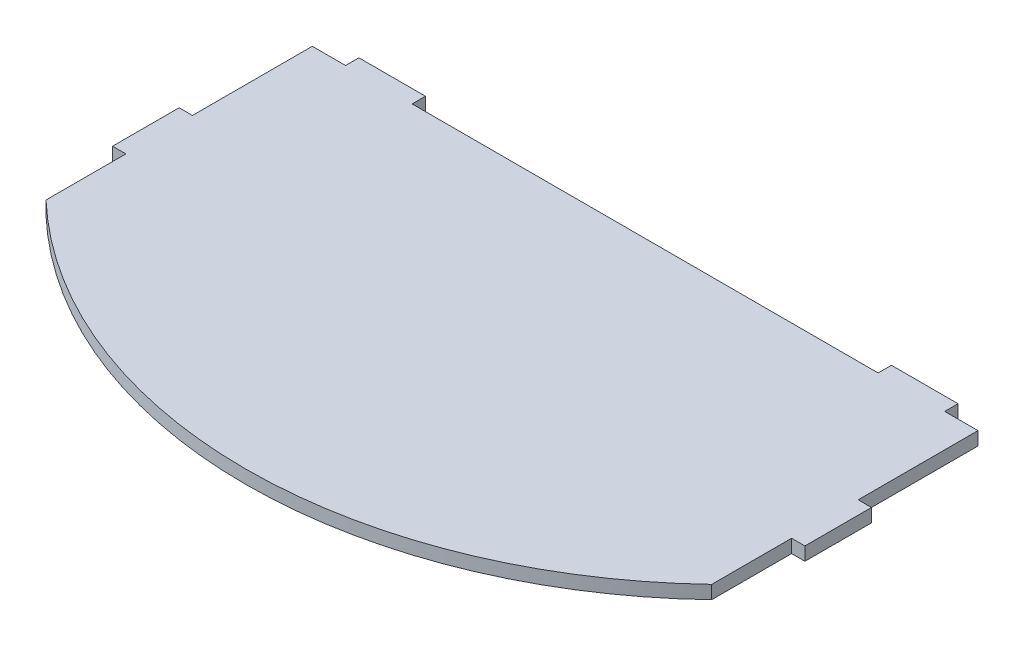
ISO-10303-21;
HEADER;
FILE_DESCRIPTION(('STEP AP214'),'2;1');
FILE_NAME('part.step','',(''),(''),'','','');
FILE_SCHEMA(('AUTOMOTIVE_DESIGN { 1 0 10303 214 1 1 1 1 }'));
ENDSEC;
DATA;
#1=APPLICATION_CONTEXT('core data for automotive mechanical design processes');
#2=APPLICATION_PROTOCOL_DEFINITION('international standard','automotive_design',2000,#1);
#3=PRODUCT_CONTEXT('',#1,'mechanical');
#4=PRODUCT('Part','Part','',(#3));
#5=PRODUCT_RELATED_PRODUCT_CATEGORY('part','',(#4));
#6=PRODUCT_DEFINITION_FORMATION('','',#4);
#7=PRODUCT_DEFINITION_CONTEXT('part definition',#1,'design');
#8=PRODUCT_DEFINITION('design','',#6,#7);
#9=PRODUCT_DEFINITION_SHAPE('','',#8);
#10=(LENGTH_UNIT() NAMED_UNIT(*) SI_UNIT(.MILLI.,.METRE.));
#11=(NAMED_UNIT(*) PLANE_ANGLE_UNIT() SI_UNIT($,.RADIAN.));
#12=(NAMED_UNIT(*) SI_UNIT($,.STERADIAN.) SOLID_ANGLE_UNIT());
#13=UNCERTAINTY_MEASURE_WITH_UNIT(LENGTH_MEASURE(1.E-05),#10,'distance_accuracy_value','');
#14=(GEOMETRIC_REPRESENTATION_CONTEXT(3) GLOBAL_UNCERTAINTY_ASSIGNED_CONTEXT((#13)) GLOBAL_UNIT_ASSIGNED_CONTEXT((#10,
#11,#12)) REPRESENTATION_CONTEXT('',''));
#15=CARTESIAN_POINT('',(0.,0.,0.));
#16=DIRECTION('',(0.,0.,1.));
#17=DIRECTION('',(1.,0.,0.));
#18=AXIS2_PLACEMENT_3D('',#15,#16,#17);
#19=CARTESIAN_POINT('',(70.,4.,0.));
#20=DIRECTION('',(-1.,0.,0.));
#21=DIRECTION('',(0.,0.,1.));
#22=AXIS2_PLACEMENT_3D('',#19,#20,#21);
#23=PLANE('',#22);
#24=DIRECTION('',(0.,0.,-1.));
#25=VECTOR('',#24,1.);
#26=CARTESIAN_POINT('',(70.,0.,0.));
#27=LINE('',#26,#25);
#28=CARTESIAN_POINT('',(70.,0.,-60.));
#29=VERTEX_POINT('',#28);
#30=CARTESIAN_POINT('',(70.,0.,-64.));
#31=VERTEX_POINT('',#30);
#32=EDGE_CURVE('E343',#29,#31,#27,.T.);
#33=ORIENTED_EDGE('',*,*,#32,.F.);
#34=DIRECTION('',(0.,-1.,0.));
#35=VECTOR('',#34,1.);
#36=CARTESIAN_POINT('',(70.,4.,-60.));
#37=LINE('',#36,#35);
#38=CARTESIAN_POINT('',(70.,4.,-60.));
#39=VERTEX_POINT('',#38);
#40=EDGE_CURVE('E377',#39,#29,#37,.T.);
#41=ORIENTED_EDGE('',*,*,#40,.F.);
#42=DIRECTION('',(0.,0.,-1.));
#43=VECTOR('',#42,1.);
#44=CARTESIAN_POINT('',(70.,4.,0.));
#45=LINE('',#44,#43);
#46=CARTESIAN_POINT('',(70.,4.,-64.));
#47=VERTEX_POINT('',#46);
#48=EDGE_CURVE('E342',#39,#47,#45,.T.);
#49=ORIENTED_EDGE('',*,*,#48,.T.);
#50=DIRECTION('',(0.,-1.,0.));
#51=VECTOR('',#50,1.);
#52=CARTESIAN_POINT('',(70.,4.,-64.));
#53=LINE('',#52,#51);
#54=EDGE_CURVE('E405',#47,#31,#53,.T.);
#55=ORIENTED_EDGE('',*,*,#54,.T.);
#56=EDGE_LOOP('',(#33,#41,#49,#55));
#57=FACE_BOUND('',#56,.T.);
#58=ADVANCED_FACE('F131',(#57),#23,.T.);
#59=CARTESIAN_POINT('',(0.,4.,-64.));
#60=DIRECTION('',(0.,0.,-1.));
#61=DIRECTION('',(-1.,0.,0.));
#62=AXIS2_PLACEMENT_3D('',#59,#60,#61);
#63=PLANE('',#62);
#64=DIRECTION('',(1.,0.,0.));
#65=VECTOR('',#64,1.);
#66=CARTESIAN_POINT('',(0.,0.,-64.));
#67=LINE('',#66,#65);
#68=CARTESIAN_POINT('',(90.,0.,-64.));
#69=VERTEX_POINT('',#68);
#70=EDGE_CURVE('E348',#31,#69,#67,.T.);
#71=ORIENTED_EDGE('',*,*,#70,.F.);
#72=ORIENTED_EDGE('',*,*,#54,.F.);
#73=DIRECTION('',(1.,0.,0.));
#74=VECTOR('',#73,1.);
#75=CARTESIAN_POINT('',(0.,4.,-64.));
#76=LINE('',#75,#74);
#77=CARTESIAN_POINT('',(90.,4.,-64.));
#78=VERTEX_POINT('',#77);
#79=EDGE_CURVE('E373',#47,#78,#76,.T.);
#80=ORIENTED_EDGE('',*,*,#79,.T.);
#81=DIRECTION('',(0.,-1.,0.));
#82=VECTOR('',#81,1.);
#83=CARTESIAN_POINT('',(90.,4.,-64.));
#84=LINE('',#83,#82);
#85=EDGE_CURVE('E407',#78,#69,#84,.T.);
#86=ORIENTED_EDGE('',*,*,#85,.T.);
#87=EDGE_LOOP('',(#71,#72,#80,#86));
#88=FACE_BOUND('',#87,.T.);
#89=ADVANCED_FACE('F477',(#88),#63,.T.);
#90=CARTESIAN_POINT('',(90.,4.,0.));
#91=DIRECTION('',(-1.,0.,0.));
#92=DIRECTION('',(0.,0.,1.));
#93=AXIS2_PLACEMENT_3D('',#90,#91,#92);
#94=PLANE('',#93);
#95=DIRECTION('',(0.,0.,-1.));
#96=VECTOR('',#95,1.);
#97=CARTESIAN_POINT('',(90.,0.,0.));
#98=LINE('',#97,#96);
#99=CARTESIAN_POINT('',(90.,0.,-60.));
#100=VERTEX_POINT('',#99);
#101=EDGE_CURVE('E399',#100,#69,#98,.T.);
#102=ORIENTED_EDGE('',*,*,#101,.T.);
#103=ORIENTED_EDGE('',*,*,#85,.F.);
#104=DIRECTION('',(0.,0.,-1.));
#105=VECTOR('',#104,1.);
#106=CARTESIAN_POINT('',(90.,4.,0.));
#107=LINE('',#106,#105);
#108=CARTESIAN_POINT('',(90.,4.,-60.));
#109=VERTEX_POINT('',#108);
#110=EDGE_CURVE('E351',#109,#78,#107,.T.);
#111=ORIENTED_EDGE('',*,*,#110,.F.);
#112=DIRECTION('',(0.,-1.,0.));
#113=VECTOR('',#112,1.);
#114=CARTESIAN_POINT('',(90.,4.,-60.));
#115=LINE('',#114,#113);
#116=EDGE_CURVE('E409',#109,#100,#115,.T.);
#117=ORIENTED_EDGE('',*,*,#116,.T.);
#118=EDGE_LOOP('',(#102,#103,#111,#117));
#119=FACE_BOUND('',#118,.T.);
#120=ADVANCED_FACE('F483',(#119),#94,.F.);
#121=CARTESIAN_POINT('',(-90.,4.,0.));
#122=DIRECTION('',(-1.,0.,0.));
#123=DIRECTION('',(0.,0.,1.));
#124=AXIS2_PLACEMENT_3D('',#121,#122,#123);
#125=PLANE('',#124);
#126=DIRECTION('',(0.,0.,-1.));
#127=VECTOR('',#126,1.);
#128=CARTESIAN_POINT('',(-90.,0.,0.));
#129=LINE('',#128,#127);
#130=CARTESIAN_POINT('',(-90.,0.,-60.));
#131=VERTEX_POINT('',#130);
#132=CARTESIAN_POINT('',(-90.,0.,-64.));
#133=VERTEX_POINT('',#132);
#134=EDGE_CURVE('E386',#131,#133,#129,.T.);
#135=ORIENTED_EDGE('',*,*,#134,.F.);
#136=DIRECTION('',(0.,-1.,0.));
#137=VECTOR('',#136,1.);
#138=CARTESIAN_POINT('',(-90.,4.,-60.));
#139=LINE('',#138,#137);
#140=CARTESIAN_POINT('',(-90.,4.,-60.));
#141=VERTEX_POINT('',#140);
#142=EDGE_CURVE('E421',#141,#131,#139,.T.);
#143=ORIENTED_EDGE('',*,*,#142,.F.);
#144=DIRECTION('',(0.,0.,-1.));
#145=VECTOR('',#144,1.);
#146=CARTESIAN_POINT('',(-90.,4.,0.));
#147=LINE('',#146,#145);
#148=CARTESIAN_POINT('',(-90.,4.,-64.));
#149=VERTEX_POINT('',#148);
#150=EDGE_CURVE('E355',#141,#149,#147,.T.);
#151=ORIENTED_EDGE('',*,*,#150,.T.);
#152=DIRECTION('',(0.,-1.,0.));
#153=VECTOR('',#152,1.);
#154=CARTESIAN_POINT('',(-90.,4.,-64.));
#155=LINE('',#154,#153);
#156=EDGE_CURVE('E423',#149,#133,#155,.T.);
#157=ORIENTED_EDGE('',*,*,#156,.T.);
#158=EDGE_LOOP('',(#135,#143,#151,#157));
#159=FACE_BOUND('',#158,.T.);
#160=ADVANCED_FACE('F492',(#159),#125,.T.);
#161=CARTESIAN_POINT('',(0.,4.,-64.));
#162=DIRECTION('',(0.,0.,-1.));
#163=DIRECTION('',(-1.,0.,0.));
#164=AXIS2_PLACEMENT_3D('',#161,#162,#163);
#165=PLANE('',#164);
#166=DIRECTION('',(1.,0.,0.));
#167=VECTOR('',#166,1.);
#168=CARTESIAN_POINT('',(0.,0.,-64.));
#169=LINE('',#168,#167);
#170=CARTESIAN_POINT('',(-70.,0.,-64.));
#171=VERTEX_POINT('',#170);
#172=EDGE_CURVE('E383',#133,#171,#169,.T.);
#173=ORIENTED_EDGE('',*,*,#172,.F.);
#174=ORIENTED_EDGE('',*,*,#156,.F.);
#175=DIRECTION('',(1.,0.,0.));
#176=VECTOR('',#175,1.);
#177=CARTESIAN_POINT('',(0.,4.,-64.));
#178=LINE('',#177,#176);
#179=CARTESIAN_POINT('',(-70.,4.,-64.));
#180=VERTEX_POINT('',#179);
#181=EDGE_CURVE('E338',#149,#180,#178,.T.);
#182=ORIENTED_EDGE('',*,*,#181,.T.);
#183=DIRECTION('',(0.,-1.,0.));
#184=VECTOR('',#183,1.);
#185=CARTESIAN_POINT('',(-70.,4.,-64.));
#186=LINE('',#185,#184);
#187=EDGE_CURVE('E331',#180,#171,#186,.T.);
#188=ORIENTED_EDGE('',*,*,#187,.T.);
#189=EDGE_LOOP('',(#173,#174,#182,#188));
#190=FACE_BOUND('',#189,.T.);
#191=ADVANCED_FACE('F506',(#190),#165,.T.);
#192=CARTESIAN_POINT('',(-70.,4.,0.));
#193=DIRECTION('',(-1.,0.,0.));
#194=DIRECTION('',(0.,0.,1.));
#195=AXIS2_PLACEMENT_3D('',#192,#193,#194);
#196=PLANE('',#195);
#197=DIRECTION('',(0.,0.,-1.));
#198=VECTOR('',#197,1.);
#199=CARTESIAN_POINT('',(-70.,0.,0.));
#200=LINE('',#199,#198);
#201=CARTESIAN_POINT('',(-70.,0.,-60.));
#202=VERTEX_POINT('',#201);
#203=EDGE_CURVE('E379',#202,#171,#200,.T.);
#204=ORIENTED_EDGE('',*,*,#203,.T.);
#205=ORIENTED_EDGE('',*,*,#187,.F.);
#206=DIRECTION('',(0.,0.,-1.));
#207=VECTOR('',#206,1.);
#208=CARTESIAN_POINT('',(-70.,4.,0.));
#209=LINE('',#208,#207);
#210=CARTESIAN_POINT('',(-70.,4.,-60.));
#211=VERTEX_POINT('',#210);
#212=EDGE_CURVE('E334',#211,#180,#209,.T.);
#213=ORIENTED_EDGE('',*,*,#212,.F.);
#214=DIRECTION('',(0.,-1.,0.));
#215=VECTOR('',#214,1.);
#216=CARTESIAN_POINT('',(-70.,4.,-60.));
#217=LINE('',#216,#215);
#218=EDGE_CURVE('E218',#211,#202,#217,.T.);
#219=ORIENTED_EDGE('',*,*,#218,.T.);
#220=EDGE_LOOP('',(#204,#205,#213,#219));
#221=FACE_BOUND('',#220,.T.);
#222=ADVANCED_FACE('F335',(#221),#196,.F.);
#223=CARTESIAN_POINT('',(0.,4.,-60.));
#224=DIRECTION('',(0.,0.,-1.));
#225=DIRECTION('',(-1.,0.,0.));
#226=AXIS2_PLACEMENT_3D('',#223,#224,#225);
#227=PLANE('',#226);
#228=DIRECTION('',(1.,0.,0.));
#229=VECTOR('',#228,1.);
#230=CARTESIAN_POINT('',(0.,0.,-60.));
#231=LINE('',#230,#229);
#232=EDGE_CURVE('E231',#202,#29,#231,.T.);
#233=ORIENTED_EDGE('',*,*,#232,.F.);
#234=ORIENTED_EDGE('',*,*,#218,.F.);
#235=DIRECTION('',(1.,0.,0.));
#236=VECTOR('',#235,1.);
#237=CARTESIAN_POINT('',(0.,4.,-60.));
#238=LINE('',#237,#236);
#239=EDGE_CURVE('E326',#211,#39,#238,.T.);
#240=ORIENTED_EDGE('',*,*,#239,.T.);
#241=ORIENTED_EDGE('',*,*,#40,.T.);
#242=EDGE_LOOP('',(#233,#234,#240,#241));
#243=FACE_BOUND('',#242,.T.);
#244=ADVANCED_FACE('F325',(#243),#227,.T.);
#245=CARTESIAN_POINT('',(-99.9999999999999,0.,-60.));
#246=VERTEX_POINT('',#245);
#247=EDGE_CURVE('E381',#246,#131,#231,.T.);
#248=ORIENTED_EDGE('',*,*,#247,.F.);
#249=DIRECTION('',(0.,-1.,0.));
#250=VECTOR('',#249,1.);
#251=CARTESIAN_POINT('',(-99.9999999999999,4.,-60.));
#252=LINE('',#251,#250);
#253=CARTESIAN_POINT('',(-99.9999999999999,4.,-60.));
#254=VERTEX_POINT('',#253);
#255=EDGE_CURVE('E419',#254,#246,#252,.T.);
#256=ORIENTED_EDGE('',*,*,#255,.F.);
#257=EDGE_CURVE('E346',#254,#141,#238,.T.);
#258=ORIENTED_EDGE('',*,*,#257,.T.);
#259=ORIENTED_EDGE('',*,*,#142,.T.);
#260=EDGE_LOOP('',(#248,#256,#258,#259));
#261=FACE_BOUND('',#260,.T.);
#262=ADVANCED_FACE('F454',(#261),#227,.T.);
#263=CARTESIAN_POINT('',(0.,4.,-85.));
#264=DIRECTION('',(0.,-1.,0.));
#265=DIRECTION('',(0.,0.,-1.));
#266=AXIS2_PLACEMENT_3D('',#263,#264,#265);
#267=CYLINDRICAL_SURFACE('',#266,145.);
#268=CARTESIAN_POINT('',(0.,0.,-85.));
#269=DIRECTION('',(0.,1.,0.));
#270=DIRECTION('',(0.,0.,1.));
#271=AXIS2_PLACEMENT_3D('',#268,#269,#270);
#272=CIRCLE('',#271,145.);
#273=CARTESIAN_POINT('',(100.,0.,20.));
#274=VERTEX_POINT('',#273);
#275=CARTESIAN_POINT('',(-99.9999999999999,0.,20.));
#276=VERTEX_POINT('',#275);
#277=EDGE_CURVE('E392',#274,#276,#272,.F.);
#278=ORIENTED_EDGE('',*,*,#277,.F.);
#279=DIRECTION('',(0.,-1.,0.));
#280=VECTOR('',#279,1.);
#281=CARTESIAN_POINT('',(100.,4.,20.));
#282=LINE('',#281,#280);
#283=CARTESIAN_POINT('',(100.,4.,20.));
#284=VERTEX_POINT('',#283);
#285=EDGE_CURVE('E413',#284,#274,#282,.T.);
#286=ORIENTED_EDGE('',*,*,#285,.F.);
#287=CARTESIAN_POINT('',(0.,4.,-85.));
#288=DIRECTION('',(0.,1.,0.));
#289=DIRECTION('',(0.,0.,1.));
#290=AXIS2_PLACEMENT_3D('',#287,#288,#289);
#291=CIRCLE('',#290,145.);
#292=CARTESIAN_POINT('',(-99.9999999999999,4.,20.));
#293=VERTEX_POINT('',#292);
#294=EDGE_CURVE('E367',#284,#293,#291,.F.);
#295=ORIENTED_EDGE('',*,*,#294,.T.);
#296=DIRECTION('',(0.,-1.,0.));
#297=VECTOR('',#296,1.);
#298=CARTESIAN_POINT('',(-99.9999999999999,4.,20.));
#299=LINE('',#298,#297);
#300=EDGE_CURVE('E416',#293,#276,#299,.T.);
#301=ORIENTED_EDGE('',*,*,#300,.T.);
#302=EDGE_LOOP('',(#278,#286,#295,#301));
#303=FACE_BOUND('',#302,.T.);
#304=ADVANCED_FACE('F496',(#303),#267,.T.);
#305=CARTESIAN_POINT('',(100.,0.,-60.));
#306=VERTEX_POINT('',#305);
#307=EDGE_CURVE('E380',#100,#306,#231,.T.);
#308=ORIENTED_EDGE('',*,*,#307,.F.);
#309=ORIENTED_EDGE('',*,*,#116,.F.);
#310=CARTESIAN_POINT('',(100.,4.,-60.));
#311=VERTEX_POINT('',#310);
#312=EDGE_CURVE('E345',#109,#311,#238,.T.);
#313=ORIENTED_EDGE('',*,*,#312,.T.);
#314=DIRECTION('',(0.,-1.,0.));
#315=VECTOR('',#314,1.);
#316=CARTESIAN_POINT('',(100.,4.,-60.));
#317=LINE('',#316,#315);
#318=EDGE_CURVE('E411',#311,#306,#317,.T.);
#319=ORIENTED_EDGE('',*,*,#318,.T.);
#320=EDGE_LOOP('',(#308,#309,#313,#319));
#321=FACE_BOUND('',#320,.T.);
#322=ADVANCED_FACE('F461',(#321),#227,.T.);
#323=CARTESIAN_POINT('',(0.,0.,0.));
#324=DIRECTION('',(0.,1.,0.));
#325=DIRECTION('',(0.,0.,1.));
#326=AXIS2_PLACEMENT_3D('',#323,#324,#325);
#327=PLANE('',#326);
#328=ORIENTED_EDGE('',*,*,#232,.T.);
#329=ORIENTED_EDGE('',*,*,#32,.T.);
#330=ORIENTED_EDGE('',*,*,#70,.T.);
#331=ORIENTED_EDGE('',*,*,#101,.F.);
#332=ORIENTED_EDGE('',*,*,#307,.T.);
#333=DIRECTION('',(0.,0.,1.));
#334=VECTOR('',#333,1.);
#335=CARTESIAN_POINT('',(100.,0.,0.));
#336=LINE('',#335,#334);
#337=CARTESIAN_POINT('',(100.,0.,-24.));
#338=VERTEX_POINT('',#337);
#339=EDGE_CURVE('E397',#306,#338,#336,.T.);
#340=ORIENTED_EDGE('',*,*,#339,.T.);
#341=DIRECTION('',(1.,0.,0.));
#342=VECTOR('',#341,1.);
#343=CARTESIAN_POINT('',(99.9999999999999,0.,-24.));
#344=LINE('',#343,#342);
#345=CARTESIAN_POINT('',(104.,0.,-24.));
#346=VERTEX_POINT('',#345);
#347=EDGE_CURVE('E210',#338,#346,#344,.T.);
#348=ORIENTED_EDGE('',*,*,#347,.T.);
#349=DIRECTION('',(0.,0.,1.));
#350=VECTOR('',#349,1.);
#351=CARTESIAN_POINT('',(104.,0.,-24.));
#352=LINE('',#351,#350);
#353=CARTESIAN_POINT('',(104.,0.,-3.99999999999998));
#354=VERTEX_POINT('',#353);
#355=EDGE_CURVE('E188',#346,#354,#352,.T.);
#356=ORIENTED_EDGE('',*,*,#355,.T.);
#357=DIRECTION('',(1.,0.,0.));
#358=VECTOR('',#357,1.);
#359=CARTESIAN_POINT('',(99.9999999999999,0.,-3.99999999999998));
#360=LINE('',#359,#358);
#361=CARTESIAN_POINT('',(100.,0.,-3.99999999999998));
#362=VERTEX_POINT('',#361);
#363=EDGE_CURVE('E197',#362,#354,#360,.T.);
#364=ORIENTED_EDGE('',*,*,#363,.F.);
#365=EDGE_CURVE('E396',#362,#274,#336,.T.);
#366=ORIENTED_EDGE('',*,*,#365,.T.);
#367=ORIENTED_EDGE('',*,*,#277,.T.);
#368=DIRECTION('',(0.,0.,1.));
#369=VECTOR('',#368,1.);
#370=CARTESIAN_POINT('',(-99.9999999999999,0.,0.));
#371=LINE('',#370,#369);
#372=CARTESIAN_POINT('',(-99.9999999999999,0.,-3.99999999999998));
#373=VERTEX_POINT('',#372);
#374=EDGE_CURVE('E393',#373,#276,#371,.T.);
#375=ORIENTED_EDGE('',*,*,#374,.F.);
#376=DIRECTION('',(-1.,0.,0.));
#377=VECTOR('',#376,1.);
#378=CARTESIAN_POINT('',(-99.9999999999999,0.,-3.99999999999998));
#379=LINE('',#378,#377);
#380=CARTESIAN_POINT('',(-104.,0.,-3.99999999999998));
#381=VERTEX_POINT('',#380);
#382=EDGE_CURVE('E430',#373,#381,#379,.T.);
#383=ORIENTED_EDGE('',*,*,#382,.T.);
#384=DIRECTION('',(0.,0.,1.));
#385=VECTOR('',#384,1.);
#386=CARTESIAN_POINT('',(-104.,0.,-24.));
#387=LINE('',#386,#385);
#388=CARTESIAN_POINT('',(-104.,0.,-24.));
#389=VERTEX_POINT('',#388);
#390=EDGE_CURVE('E435',#389,#381,#387,.T.);
#391=ORIENTED_EDGE('',*,*,#390,.F.);
#392=DIRECTION('',(-1.,0.,0.));
#393=VECTOR('',#392,1.);
#394=CARTESIAN_POINT('',(-99.9999999999999,0.,-24.));
#395=LINE('',#394,#393);
#396=CARTESIAN_POINT('',(-99.9999999999999,0.,-24.));
#397=VERTEX_POINT('',#396);
#398=EDGE_CURVE('E194',#397,#389,#395,.T.);
#399=ORIENTED_EDGE('',*,*,#398,.F.);
#400=EDGE_CURVE('E389',#246,#397,#371,.T.);
#401=ORIENTED_EDGE('',*,*,#400,.F.);
#402=ORIENTED_EDGE('',*,*,#247,.T.);
#403=ORIENTED_EDGE('',*,*,#134,.T.);
#404=ORIENTED_EDGE('',*,*,#172,.T.);
#405=ORIENTED_EDGE('',*,*,#203,.F.);
#406=EDGE_LOOP('',(#328,#329,#330,#331,#332,#340,#348,#356,#364,#366,#367,#375,#383,#391,#399,
#401,#402,#403,#404,#405));
#407=FACE_BOUND('',#406,.T.);
#408=ADVANCED_FACE('F208',(#407),#327,.F.);
#409=CARTESIAN_POINT('',(0.,4.,0.));
#410=DIRECTION('',(0.,1.,0.));
#411=DIRECTION('',(0.,0.,1.));
#412=AXIS2_PLACEMENT_3D('',#409,#410,#411);
#413=PLANE('',#412);
#414=ORIENTED_EDGE('',*,*,#239,.F.);
#415=ORIENTED_EDGE('',*,*,#212,.T.);
#416=ORIENTED_EDGE('',*,*,#181,.F.);
#417=ORIENTED_EDGE('',*,*,#150,.F.);
#418=ORIENTED_EDGE('',*,*,#257,.F.);
#419=DIRECTION('',(0.,0.,1.));
#420=VECTOR('',#419,1.);
#421=CARTESIAN_POINT('',(-99.9999999999999,4.,0.));
#422=LINE('',#421,#420);
#423=CARTESIAN_POINT('',(-99.9999999999999,4.,-24.));
#424=VERTEX_POINT('',#423);
#425=EDGE_CURVE('E358',#254,#424,#422,.T.);
#426=ORIENTED_EDGE('',*,*,#425,.T.);
#427=DIRECTION('',(-1.,0.,0.));
#428=VECTOR('',#427,1.);
#429=CARTESIAN_POINT('',(-99.9999999999999,4.,-24.));
#430=LINE('',#429,#428);
#431=CARTESIAN_POINT('',(-104.,4.,-24.));
#432=VERTEX_POINT('',#431);
#433=EDGE_CURVE('E426',#424,#432,#430,.T.);
#434=ORIENTED_EDGE('',*,*,#433,.T.);
#435=DIRECTION('',(0.,0.,1.));
#436=VECTOR('',#435,1.);
#437=CARTESIAN_POINT('',(-104.,4.,-24.));
#438=LINE('',#437,#436);
#439=CARTESIAN_POINT('',(-104.,4.,-3.99999999999998));
#440=VERTEX_POINT('',#439);
#441=EDGE_CURVE('E429',#432,#440,#438,.T.);
#442=ORIENTED_EDGE('',*,*,#441,.T.);
#443=DIRECTION('',(-1.,0.,0.));
#444=VECTOR('',#443,1.);
#445=CARTESIAN_POINT('',(-99.9999999999999,4.,-3.99999999999998));
#446=LINE('',#445,#444);
#447=CARTESIAN_POINT('',(-99.9999999999999,4.,-3.99999999999998));
#448=VERTEX_POINT('',#447);
#449=EDGE_CURVE('E228',#448,#440,#446,.T.);
#450=ORIENTED_EDGE('',*,*,#449,.F.);
#451=EDGE_CURVE('E354',#448,#293,#422,.T.);
#452=ORIENTED_EDGE('',*,*,#451,.T.);
#453=ORIENTED_EDGE('',*,*,#294,.F.);
#454=DIRECTION('',(0.,0.,1.));
#455=VECTOR('',#454,1.);
#456=CARTESIAN_POINT('',(100.,4.,0.));
#457=LINE('',#456,#455);
#458=CARTESIAN_POINT('',(100.,4.,-3.99999999999998));
#459=VERTEX_POINT('',#458);
#460=EDGE_CURVE('E242',#459,#284,#457,.T.);
#461=ORIENTED_EDGE('',*,*,#460,.F.);
#462=DIRECTION('',(1.,0.,0.));
#463=VECTOR('',#462,1.);
#464=CARTESIAN_POINT('',(99.9999999999999,4.,-3.99999999999998));
#465=LINE('',#464,#463);
#466=CARTESIAN_POINT('',(104.,4.,-3.99999999999998));
#467=VERTEX_POINT('',#466);
#468=EDGE_CURVE('E233',#459,#467,#465,.T.);
#469=ORIENTED_EDGE('',*,*,#468,.T.);
#470=DIRECTION('',(0.,0.,1.));
#471=VECTOR('',#470,1.);
#472=CARTESIAN_POINT('',(104.,4.,-24.));
#473=LINE('',#472,#471);
#474=CARTESIAN_POINT('',(104.,4.,-24.));
#475=VERTEX_POINT('',#474);
#476=EDGE_CURVE('E191',#475,#467,#473,.T.);
#477=ORIENTED_EDGE('',*,*,#476,.F.);
#478=DIRECTION('',(1.,0.,0.));
#479=VECTOR('',#478,1.);
#480=CARTESIAN_POINT('',(99.9999999999999,4.,-24.));
#481=LINE('',#480,#479);
#482=CARTESIAN_POINT('',(100.,4.,-24.));
#483=VERTEX_POINT('',#482);
#484=EDGE_CURVE('E205',#483,#475,#481,.T.);
#485=ORIENTED_EDGE('',*,*,#484,.F.);
#486=EDGE_CURVE('E352',#311,#483,#457,.T.);
#487=ORIENTED_EDGE('',*,*,#486,.F.);
#488=ORIENTED_EDGE('',*,*,#312,.F.);
#489=ORIENTED_EDGE('',*,*,#110,.T.);
#490=ORIENTED_EDGE('',*,*,#79,.F.);
#491=ORIENTED_EDGE('',*,*,#48,.F.);
#492=EDGE_LOOP('',(#414,#415,#416,#417,#418,#426,#434,#442,#450,#452,#453,#461,#469,#477,#485,
#487,#488,#489,#490,#491));
#493=FACE_BOUND('',#492,.T.);
#494=ADVANCED_FACE('F237',(#493),#413,.T.);
#495=CARTESIAN_POINT('',(100.,4.,0.));
#496=DIRECTION('',(1.,0.,0.));
#497=DIRECTION('',(0.,0.,-1.));
#498=AXIS2_PLACEMENT_3D('',#495,#496,#497);
#499=PLANE('',#498);
#500=ORIENTED_EDGE('',*,*,#486,.T.);
#501=DIRECTION('',(0.,-1.,0.));
#502=VECTOR('',#501,1.);
#503=CARTESIAN_POINT('',(99.9999999999999,4.,-24.));
#504=LINE('',#503,#502);
#505=EDGE_CURVE('E215',#483,#338,#504,.T.);
#506=ORIENTED_EDGE('',*,*,#505,.T.);
#507=ORIENTED_EDGE('',*,*,#339,.F.);
#508=ORIENTED_EDGE('',*,*,#318,.F.);
#509=EDGE_LOOP('',(#500,#506,#507,#508));
#510=FACE_BOUND('',#509,.T.);
#511=ADVANCED_FACE('F466',(#510),#499,.T.);
#512=DIRECTION('',(0.,-1.,0.));
#513=VECTOR('',#512,1.);
#514=CARTESIAN_POINT('',(99.9999999999999,4.,-3.99999999999998));
#515=LINE('',#514,#513);
#516=EDGE_CURVE('E201',#459,#362,#515,.T.);
#517=ORIENTED_EDGE('',*,*,#516,.F.);
#518=ORIENTED_EDGE('',*,*,#460,.T.);
#519=ORIENTED_EDGE('',*,*,#285,.T.);
#520=ORIENTED_EDGE('',*,*,#365,.F.);
#521=EDGE_LOOP('',(#517,#518,#519,#520));
#522=FACE_BOUND('',#521,.T.);
#523=ADVANCED_FACE('F497',(#522),#499,.T.);
#524=CARTESIAN_POINT('',(-99.9999999999999,4.,0.));
#525=DIRECTION('',(1.,0.,0.));
#526=DIRECTION('',(0.,0.,-1.));
#527=AXIS2_PLACEMENT_3D('',#524,#525,#526);
#528=PLANE('',#527);
#529=ORIENTED_EDGE('',*,*,#451,.F.);
#530=DIRECTION('',(0.,-1.,0.));
#531=VECTOR('',#530,1.);
#532=CARTESIAN_POINT('',(-99.9999999999999,4.,-3.99999999999998));
#533=LINE('',#532,#531);
#534=EDGE_CURVE('E141',#448,#373,#533,.T.);
#535=ORIENTED_EDGE('',*,*,#534,.T.);
#536=ORIENTED_EDGE('',*,*,#374,.T.);
#537=ORIENTED_EDGE('',*,*,#300,.F.);
#538=EDGE_LOOP('',(#529,#535,#536,#537));
#539=FACE_BOUND('',#538,.T.);
#540=ADVANCED_FACE('F474',(#539),#528,.F.);
#541=DIRECTION('',(0.,-1.,0.));
#542=VECTOR('',#541,1.);
#543=CARTESIAN_POINT('',(-99.9999999999999,4.,-24.));
#544=LINE('',#543,#542);
#545=EDGE_CURVE('E12',#424,#397,#544,.T.);
#546=ORIENTED_EDGE('',*,*,#545,.F.);
#547=ORIENTED_EDGE('',*,*,#425,.F.);
#548=ORIENTED_EDGE('',*,*,#255,.T.);
#549=ORIENTED_EDGE('',*,*,#400,.T.);
#550=EDGE_LOOP('',(#546,#547,#548,#549));
#551=FACE_BOUND('',#550,.T.);
#552=ADVANCED_FACE('F452',(#551),#528,.F.);
#553=CARTESIAN_POINT('',(104.,4.,-24.));
#554=DIRECTION('',(1.,0.,0.));
#555=DIRECTION('',(0.,0.,-1.));
#556=AXIS2_PLACEMENT_3D('',#553,#554,#555);
#557=PLANE('',#556);
#558=ORIENTED_EDGE('',*,*,#355,.F.);
#559=DIRECTION('',(0.,-1.,0.));
#560=VECTOR('',#559,1.);
#561=CARTESIAN_POINT('',(104.,4.,-24.));
#562=LINE('',#561,#560);
#563=EDGE_CURVE('E135',#475,#346,#562,.T.);
#564=ORIENTED_EDGE('',*,*,#563,.F.);
#565=ORIENTED_EDGE('',*,*,#476,.T.);
#566=DIRECTION('',(0.,-1.,0.));
#567=VECTOR('',#566,1.);
#568=CARTESIAN_POINT('',(104.,4.,-3.99999999999998));
#569=LINE('',#568,#567);
#570=EDGE_CURVE('E184',#467,#354,#569,.T.);
#571=ORIENTED_EDGE('',*,*,#570,.T.);
#572=EDGE_LOOP('',(#558,#564,#565,#571));
#573=FACE_BOUND('',#572,.T.);
#574=ADVANCED_FACE('F186',(#573),#557,.T.);
#575=CARTESIAN_POINT('',(99.9999999999999,4.,-24.));
#576=DIRECTION('',(0.,0.,-1.));
#577=DIRECTION('',(-1.,0.,0.));
#578=AXIS2_PLACEMENT_3D('',#575,#576,#577);
#579=PLANE('',#578);
#580=ORIENTED_EDGE('',*,*,#347,.F.);
#581=ORIENTED_EDGE('',*,*,#505,.F.);
#582=ORIENTED_EDGE('',*,*,#484,.T.);
#583=ORIENTED_EDGE('',*,*,#563,.T.);
#584=EDGE_LOOP('',(#580,#581,#582,#583));
#585=FACE_BOUND('',#584,.T.);
#586=ADVANCED_FACE('F133',(#585),#579,.T.);
#587=CARTESIAN_POINT('',(99.9999999999999,4.,-3.99999999999998));
#588=DIRECTION('',(0.,0.,-1.));
#589=DIRECTION('',(-1.,0.,0.));
#590=AXIS2_PLACEMENT_3D('',#587,#588,#589);
#591=PLANE('',#590);
#592=ORIENTED_EDGE('',*,*,#363,.T.);
#593=ORIENTED_EDGE('',*,*,#570,.F.);
#594=ORIENTED_EDGE('',*,*,#468,.F.);
#595=ORIENTED_EDGE('',*,*,#516,.T.);
#596=EDGE_LOOP('',(#592,#593,#594,#595));
#597=FACE_BOUND('',#596,.T.);
#598=ADVANCED_FACE('F198',(#597),#591,.F.);
#599=CARTESIAN_POINT('',(-104.,4.,-24.));
#600=DIRECTION('',(1.,0.,0.));
#601=DIRECTION('',(0.,0.,-1.));
#602=AXIS2_PLACEMENT_3D('',#599,#600,#601);
#603=PLANE('',#602);
#604=ORIENTED_EDGE('',*,*,#390,.T.);
#605=DIRECTION('',(0.,-1.,0.));
#606=VECTOR('',#605,1.);
#607=CARTESIAN_POINT('',(-104.,4.,-3.99999999999998));
#608=LINE('',#607,#606);
#609=EDGE_CURVE('E225',#440,#381,#608,.T.);
#610=ORIENTED_EDGE('',*,*,#609,.F.);
#611=ORIENTED_EDGE('',*,*,#441,.F.);
#612=DIRECTION('',(0.,-1.,0.));
#613=VECTOR('',#612,1.);
#614=CARTESIAN_POINT('',(-104.,4.,-24.));
#615=LINE('',#614,#613);
#616=EDGE_CURVE('E227',#432,#389,#615,.T.);
#617=ORIENTED_EDGE('',*,*,#616,.T.);
#618=EDGE_LOOP('',(#604,#610,#611,#617));
#619=FACE_BOUND('',#618,.T.);
#620=ADVANCED_FACE('F443',(#619),#603,.F.);
#621=CARTESIAN_POINT('',(-99.9999999999999,4.,-3.99999999999998));
#622=DIRECTION('',(0.,0.,1.));
#623=DIRECTION('',(1.,0.,0.));
#624=AXIS2_PLACEMENT_3D('',#621,#622,#623);
#625=PLANE('',#624);
#626=ORIENTED_EDGE('',*,*,#382,.F.);
#627=ORIENTED_EDGE('',*,*,#534,.F.);
#628=ORIENTED_EDGE('',*,*,#449,.T.);
#629=ORIENTED_EDGE('',*,*,#609,.T.);
#630=EDGE_LOOP('',(#626,#627,#628,#629));
#631=FACE_BOUND('',#630,.T.);
#632=ADVANCED_FACE('F440',(#631),#625,.T.);
#633=CARTESIAN_POINT('',(-99.9999999999999,4.,-24.));
#634=DIRECTION('',(0.,0.,1.));
#635=DIRECTION('',(1.,0.,0.));
#636=AXIS2_PLACEMENT_3D('',#633,#634,#635);
#637=PLANE('',#636);
#638=ORIENTED_EDGE('',*,*,#398,.T.);
#639=ORIENTED_EDGE('',*,*,#616,.F.);
#640=ORIENTED_EDGE('',*,*,#433,.F.);
#641=ORIENTED_EDGE('',*,*,#545,.T.);
#642=EDGE_LOOP('',(#638,#639,#640,#641));
#643=FACE_BOUND('',#642,.T.);
#644=ADVANCED_FACE('F447',(#643),#637,.F.);
#645=CLOSED_SHELL('',(#58,#89,#120,#160,#191,#222,#244,#262,#304,#322,#408,#494,#511,#523,#540,
#552,#574,#586,#598,#620,#632,#644));
#646=MANIFOLD_SOLID_BREP('B2',#645);
#647=ADVANCED_BREP_SHAPE_REPRESENTATION('',(#18,#646),#14);
#648=SHAPE_DEFINITION_REPRESENTATION(#9,#647);
ENDSEC;
END-ISO-10303-21;
